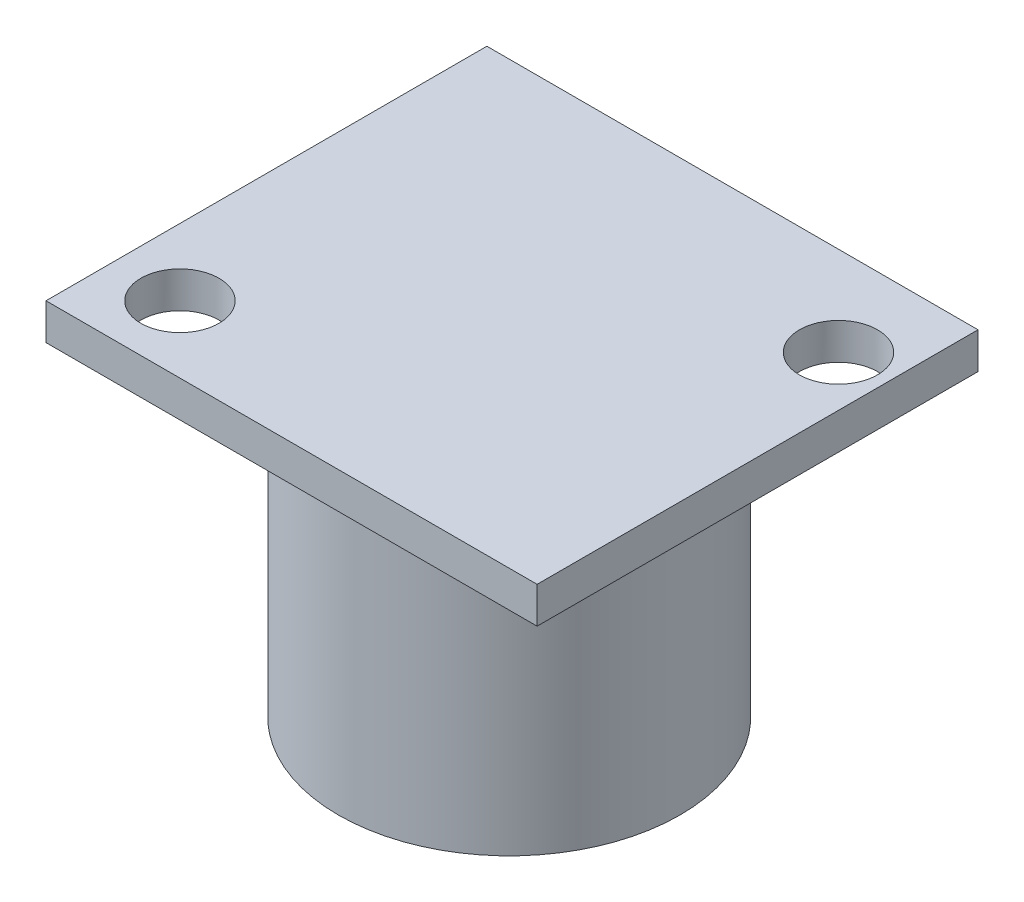
ISO-10303-21;
HEADER;
FILE_DESCRIPTION(('STEP AP214'),'2;1');
FILE_NAME('part.step','',(''),(''),'','','');
FILE_SCHEMA(('AUTOMOTIVE_DESIGN { 1 0 10303 214 1 1 1 1 }'));
ENDSEC;
DATA;
#1=APPLICATION_CONTEXT('core data for automotive mechanical design processes');
#2=APPLICATION_PROTOCOL_DEFINITION('international standard','automotive_design',2000,#1);
#3=PRODUCT_CONTEXT('',#1,'mechanical');
#4=PRODUCT('Part','Part','',(#3));
#5=PRODUCT_RELATED_PRODUCT_CATEGORY('part','',(#4));
#6=PRODUCT_DEFINITION_FORMATION('','',#4);
#7=PRODUCT_DEFINITION_CONTEXT('part definition',#1,'design');
#8=PRODUCT_DEFINITION('design','',#6,#7);
#9=PRODUCT_DEFINITION_SHAPE('','',#8);
#10=(LENGTH_UNIT() NAMED_UNIT(*) SI_UNIT(.MILLI.,.METRE.));
#11=(NAMED_UNIT(*) PLANE_ANGLE_UNIT() SI_UNIT($,.RADIAN.));
#12=(NAMED_UNIT(*) SI_UNIT($,.STERADIAN.) SOLID_ANGLE_UNIT());
#13=UNCERTAINTY_MEASURE_WITH_UNIT(LENGTH_MEASURE(1.E-05),#10,'distance_accuracy_value','');
#14=(GEOMETRIC_REPRESENTATION_CONTEXT(3) GLOBAL_UNCERTAINTY_ASSIGNED_CONTEXT((#13)) GLOBAL_UNIT_ASSIGNED_CONTEXT((#10,
#11,#12)) REPRESENTATION_CONTEXT('',''));
#15=CARTESIAN_POINT('',(0.,0.,0.));
#16=DIRECTION('',(0.,0.,1.));
#17=DIRECTION('',(1.,0.,0.));
#18=AXIS2_PLACEMENT_3D('',#15,#16,#17);
#19=CARTESIAN_POINT('',(0.,1.651,0.));
#20=DIRECTION('',(1.,0.,0.));
#21=DIRECTION('',(0.,0.,-1.));
#22=AXIS2_PLACEMENT_3D('',#19,#20,#21);
#23=PLANE('',#22);
#24=DIRECTION('',(0.,0.,1.));
#25=VECTOR('',#24,1.);
#26=CARTESIAN_POINT('',(0.,0.,0.));
#27=LINE('',#26,#25);
#28=CARTESIAN_POINT('',(0.,0.,-20.066));
#29=VERTEX_POINT('',#28);
#30=CARTESIAN_POINT('',(0.,0.,0.));
#31=VERTEX_POINT('',#30);
#32=EDGE_CURVE('E99',#29,#31,#27,.T.);
#33=ORIENTED_EDGE('',*,*,#32,.T.);
#34=DIRECTION('',(0.,-1.,0.));
#35=VECTOR('',#34,1.);
#36=CARTESIAN_POINT('',(0.,1.651,0.));
#37=LINE('',#36,#35);
#38=CARTESIAN_POINT('',(0.,1.651,0.));
#39=VERTEX_POINT('',#38);
#40=EDGE_CURVE('E41',#39,#31,#37,.T.);
#41=ORIENTED_EDGE('',*,*,#40,.F.);
#42=DIRECTION('',(0.,0.,1.));
#43=VECTOR('',#42,1.);
#44=CARTESIAN_POINT('',(0.,1.651,0.));
#45=LINE('',#44,#43);
#46=CARTESIAN_POINT('',(0.,1.651,-20.066));
#47=VERTEX_POINT('',#46);
#48=EDGE_CURVE('E85',#47,#39,#45,.T.);
#49=ORIENTED_EDGE('',*,*,#48,.F.);
#50=DIRECTION('',(0.,-1.,0.));
#51=VECTOR('',#50,1.);
#52=CARTESIAN_POINT('',(0.,1.651,-20.066));
#53=LINE('',#52,#51);
#54=EDGE_CURVE('E95',#47,#29,#53,.T.);
#55=ORIENTED_EDGE('',*,*,#54,.T.);
#56=EDGE_LOOP('',(#33,#41,#49,#55));
#57=FACE_BOUND('',#56,.T.);
#58=ADVANCED_FACE('F33',(#57),#23,.F.);
#59=CARTESIAN_POINT('',(0.,1.651,0.));
#60=DIRECTION('',(0.,0.,-1.));
#61=DIRECTION('',(-1.,0.,0.));
#62=AXIS2_PLACEMENT_3D('',#59,#60,#61);
#63=PLANE('',#62);
#64=DIRECTION('',(1.,0.,0.));
#65=VECTOR('',#64,1.);
#66=CARTESIAN_POINT('',(0.,0.,0.));
#67=LINE('',#66,#65);
#68=CARTESIAN_POINT('',(22.352,0.,0.));
#69=VERTEX_POINT('',#68);
#70=EDGE_CURVE('E90',#31,#69,#67,.T.);
#71=ORIENTED_EDGE('',*,*,#70,.T.);
#72=DIRECTION('',(0.,-1.,0.));
#73=VECTOR('',#72,1.);
#74=CARTESIAN_POINT('',(22.352,1.651,0.));
#75=LINE('',#74,#73);
#76=CARTESIAN_POINT('',(22.352,1.651,0.));
#77=VERTEX_POINT('',#76);
#78=EDGE_CURVE('E88',#77,#69,#75,.T.);
#79=ORIENTED_EDGE('',*,*,#78,.F.);
#80=DIRECTION('',(1.,0.,0.));
#81=VECTOR('',#80,1.);
#82=CARTESIAN_POINT('',(0.,1.651,0.));
#83=LINE('',#82,#81);
#84=EDGE_CURVE('E80',#39,#77,#83,.T.);
#85=ORIENTED_EDGE('',*,*,#84,.F.);
#86=ORIENTED_EDGE('',*,*,#40,.T.);
#87=EDGE_LOOP('',(#71,#79,#85,#86));
#88=FACE_BOUND('',#87,.T.);
#89=ADVANCED_FACE('F89',(#88),#63,.F.);
#90=CARTESIAN_POINT('',(22.352,1.651,0.));
#91=DIRECTION('',(-1.,0.,0.));
#92=DIRECTION('',(0.,0.,1.));
#93=AXIS2_PLACEMENT_3D('',#90,#91,#92);
#94=PLANE('',#93);
#95=DIRECTION('',(0.,0.,-1.));
#96=VECTOR('',#95,1.);
#97=CARTESIAN_POINT('',(22.352,0.,0.));
#98=LINE('',#97,#96);
#99=CARTESIAN_POINT('',(22.352,0.,-20.066));
#100=VERTEX_POINT('',#99);
#101=EDGE_CURVE('E66',#69,#100,#98,.T.);
#102=ORIENTED_EDGE('',*,*,#101,.T.);
#103=DIRECTION('',(0.,-1.,0.));
#104=VECTOR('',#103,1.);
#105=CARTESIAN_POINT('',(22.352,1.651,-20.066));
#106=LINE('',#105,#104);
#107=CARTESIAN_POINT('',(22.352,1.651,-20.066));
#108=VERTEX_POINT('',#107);
#109=EDGE_CURVE('E91',#108,#100,#106,.T.);
#110=ORIENTED_EDGE('',*,*,#109,.F.);
#111=DIRECTION('',(0.,0.,-1.));
#112=VECTOR('',#111,1.);
#113=CARTESIAN_POINT('',(22.352,1.651,0.));
#114=LINE('',#113,#112);
#115=EDGE_CURVE('E83',#77,#108,#114,.T.);
#116=ORIENTED_EDGE('',*,*,#115,.F.);
#117=ORIENTED_EDGE('',*,*,#78,.T.);
#118=EDGE_LOOP('',(#102,#110,#116,#117));
#119=FACE_BOUND('',#118,.T.);
#120=ADVANCED_FACE('F93',(#119),#94,.F.);
#121=CARTESIAN_POINT('',(0.,1.651,-20.066));
#122=DIRECTION('',(0.,0.,1.));
#123=DIRECTION('',(1.,0.,0.));
#124=AXIS2_PLACEMENT_3D('',#121,#122,#123);
#125=PLANE('',#124);
#126=DIRECTION('',(-1.,0.,0.));
#127=VECTOR('',#126,1.);
#128=CARTESIAN_POINT('',(0.,0.,-20.066));
#129=LINE('',#128,#127);
#130=EDGE_CURVE('E72',#100,#29,#129,.T.);
#131=ORIENTED_EDGE('',*,*,#130,.T.);
#132=ORIENTED_EDGE('',*,*,#54,.F.);
#133=DIRECTION('',(-1.,0.,0.));
#134=VECTOR('',#133,1.);
#135=CARTESIAN_POINT('',(0.,1.651,-20.066));
#136=LINE('',#135,#134);
#137=EDGE_CURVE('E49',#108,#47,#136,.T.);
#138=ORIENTED_EDGE('',*,*,#137,.F.);
#139=ORIENTED_EDGE('',*,*,#109,.T.);
#140=EDGE_LOOP('',(#131,#132,#138,#139));
#141=FACE_BOUND('',#140,.T.);
#142=ADVANCED_FACE('F123',(#141),#125,.F.);
#143=CARTESIAN_POINT('',(0.,1.651,0.));
#144=DIRECTION('',(0.,-1.,0.));
#145=DIRECTION('',(0.,0.,-1.));
#146=AXIS2_PLACEMENT_3D('',#143,#144,#145);
#147=PLANE('',#146);
#148=CARTESIAN_POINT('',(3.048,1.651,-3.048));
#149=DIRECTION('',(0.,1.,0.));
#150=DIRECTION('',(0.,0.,1.));
#151=AXIS2_PLACEMENT_3D('',#148,#149,#150);
#152=CIRCLE('',#151,1.778);
#153=CARTESIAN_POINT('',(3.048,1.651,-1.27));
#154=VERTEX_POINT('',#153);
#155=EDGE_CURVE('E102',#154,#154,#152,.T.);
#156=ORIENTED_EDGE('',*,*,#155,.F.);
#157=EDGE_LOOP('',(#156));
#158=FACE_BOUND('',#157,.T.);
#159=CARTESIAN_POINT('',(20.066,1.651,-16.002));
#160=DIRECTION('',(0.,1.,0.));
#161=DIRECTION('',(0.,0.,1.));
#162=AXIS2_PLACEMENT_3D('',#159,#160,#161);
#163=CIRCLE('',#162,1.778);
#164=CARTESIAN_POINT('',(20.066,1.651,-14.224));
#165=VERTEX_POINT('',#164);
#166=EDGE_CURVE('E227',#165,#165,#163,.T.);
#167=ORIENTED_EDGE('',*,*,#166,.F.);
#168=EDGE_LOOP('',(#167));
#169=FACE_BOUND('',#168,.T.);
#170=ORIENTED_EDGE('',*,*,#48,.T.);
#171=ORIENTED_EDGE('',*,*,#84,.T.);
#172=ORIENTED_EDGE('',*,*,#115,.T.);
#173=ORIENTED_EDGE('',*,*,#137,.T.);
#174=EDGE_LOOP('',(#170,#171,#172,#173));
#175=FACE_BOUND('',#174,.T.);
#176=ADVANCED_FACE('F81',(#158,#169,#175),#147,.F.);
#177=CARTESIAN_POINT('',(0.,0.,0.));
#178=DIRECTION('',(0.,-1.,0.));
#179=DIRECTION('',(0.,0.,-1.));
#180=AXIS2_PLACEMENT_3D('',#177,#178,#179);
#181=PLANE('',#180);
#182=CARTESIAN_POINT('',(11.557,0.,-9.525));
#183=DIRECTION('',(0.,-1.,0.));
#184=DIRECTION('',(0.,0.,-1.));
#185=AXIS2_PLACEMENT_3D('',#182,#183,#184);
#186=CIRCLE('',#185,7.77564841938252);
#187=CARTESIAN_POINT('',(11.557,0.,-17.3006484193825));
#188=VERTEX_POINT('',#187);
#189=EDGE_CURVE('E213',#188,#188,#186,.T.);
#190=ORIENTED_EDGE('',*,*,#189,.F.);
#191=EDGE_LOOP('',(#190));
#192=FACE_BOUND('',#191,.T.);
#193=CARTESIAN_POINT('',(3.048,0.,-3.048));
#194=DIRECTION('',(0.,-1.,0.));
#195=DIRECTION('',(0.,0.,-1.));
#196=AXIS2_PLACEMENT_3D('',#193,#194,#195);
#197=CIRCLE('',#196,1.778);
#198=CARTESIAN_POINT('',(3.048,0.,-4.826));
#199=VERTEX_POINT('',#198);
#200=EDGE_CURVE('E224',#199,#199,#197,.F.);
#201=ORIENTED_EDGE('',*,*,#200,.T.);
#202=EDGE_LOOP('',(#201));
#203=FACE_BOUND('',#202,.T.);
#204=CARTESIAN_POINT('',(20.066,0.,-16.002));
#205=DIRECTION('',(0.,-1.,0.));
#206=DIRECTION('',(0.,0.,-1.));
#207=AXIS2_PLACEMENT_3D('',#204,#205,#206);
#208=CIRCLE('',#207,1.778);
#209=CARTESIAN_POINT('',(20.066,0.,-17.78));
#210=VERTEX_POINT('',#209);
#211=EDGE_CURVE('E220',#210,#210,#208,.F.);
#212=ORIENTED_EDGE('',*,*,#211,.T.);
#213=EDGE_LOOP('',(#212));
#214=FACE_BOUND('',#213,.T.);
#215=ORIENTED_EDGE('',*,*,#32,.F.);
#216=ORIENTED_EDGE('',*,*,#130,.F.);
#217=ORIENTED_EDGE('',*,*,#101,.F.);
#218=ORIENTED_EDGE('',*,*,#70,.F.);
#219=EDGE_LOOP('',(#215,#216,#217,#218));
#220=FACE_BOUND('',#219,.T.);
#221=ADVANCED_FACE('F110',(#192,#203,#214,#220),#181,.T.);
#222=CARTESIAN_POINT('',(20.066,-0.000999999999999916,-16.002));
#223=DIRECTION('',(0.,1.,0.));
#224=DIRECTION('',(0.,0.,1.));
#225=AXIS2_PLACEMENT_3D('',#222,#223,#224);
#226=CYLINDRICAL_SURFACE('',#225,1.778);
#227=ORIENTED_EDGE('',*,*,#211,.F.);
#228=EDGE_LOOP('',(#227));
#229=FACE_BOUND('',#228,.T.);
#230=ORIENTED_EDGE('',*,*,#166,.T.);
#231=EDGE_LOOP('',(#230));
#232=FACE_BOUND('',#231,.T.);
#233=ADVANCED_FACE('F112',(#229,#232),#226,.F.);
#234=CARTESIAN_POINT('',(3.048,-0.000999999999999916,-3.048));
#235=DIRECTION('',(0.,1.,0.));
#236=DIRECTION('',(0.,0.,1.));
#237=AXIS2_PLACEMENT_3D('',#234,#235,#236);
#238=CYLINDRICAL_SURFACE('',#237,1.778);
#239=ORIENTED_EDGE('',*,*,#200,.F.);
#240=EDGE_LOOP('',(#239));
#241=FACE_BOUND('',#240,.T.);
#242=ORIENTED_EDGE('',*,*,#155,.T.);
#243=EDGE_LOOP('',(#242));
#244=FACE_BOUND('',#243,.T.);
#245=ADVANCED_FACE('F120',(#241,#244),#238,.F.);
#246=CARTESIAN_POINT('',(11.557,-13.716,-9.525));
#247=DIRECTION('',(0.,-1.,0.));
#248=DIRECTION('',(0.,0.,-1.));
#249=AXIS2_PLACEMENT_3D('',#246,#247,#248);
#250=PLANE('',#249);
#251=CARTESIAN_POINT('',(11.557,-13.716,-9.525));
#252=DIRECTION('',(0.,-1.,0.));
#253=DIRECTION('',(0.,0.,-1.));
#254=AXIS2_PLACEMENT_3D('',#251,#252,#253);
#255=CIRCLE('',#254,7.77564841938252);
#256=CARTESIAN_POINT('',(11.557,-13.716,-17.3006484193825));
#257=VERTEX_POINT('',#256);
#258=EDGE_CURVE('E216',#257,#257,#255,.T.);
#259=ORIENTED_EDGE('',*,*,#258,.T.);
#260=EDGE_LOOP('',(#259));
#261=FACE_BOUND('',#260,.T.);
#262=CARTESIAN_POINT('',(11.557,-13.716,-9.525));
#263=DIRECTION('',(0.,-1.,0.));
#264=DIRECTION('',(0.,0.,-1.));
#265=AXIS2_PLACEMENT_3D('',#262,#263,#264);
#266=CIRCLE('',#265,6.86223451172798);
#267=CARTESIAN_POINT('',(11.557,-13.716,-16.387234511728));
#268=VERTEX_POINT('',#267);
#269=EDGE_CURVE('E210',#268,#268,#266,.T.);
#270=ORIENTED_EDGE('',*,*,#269,.F.);
#271=EDGE_LOOP('',(#270));
#272=FACE_BOUND('',#271,.T.);
#273=ADVANCED_FACE('F164',(#261,#272),#250,.T.);
#274=CARTESIAN_POINT('',(11.557,-13.716,-9.525));
#275=DIRECTION('',(0.,1.,0.));
#276=DIRECTION('',(0.,0.,1.));
#277=AXIS2_PLACEMENT_3D('',#274,#275,#276);
#278=CYLINDRICAL_SURFACE('',#277,7.77564841938252);
#279=ORIENTED_EDGE('',*,*,#258,.F.);
#280=EDGE_LOOP('',(#279));
#281=FACE_BOUND('',#280,.T.);
#282=ORIENTED_EDGE('',*,*,#189,.T.);
#283=EDGE_LOOP('',(#282));
#284=FACE_BOUND('',#283,.T.);
#285=ADVANCED_FACE('F179',(#281,#284),#278,.T.);
#286=CARTESIAN_POINT('',(11.557,-13.716,-9.525));
#287=DIRECTION('',(0.,1.,0.));
#288=DIRECTION('',(0.,0.,1.));
#289=AXIS2_PLACEMENT_3D('',#286,#287,#288);
#290=CYLINDRICAL_SURFACE('',#289,6.86223451172798);
#291=ORIENTED_EDGE('',*,*,#269,.T.);
#292=EDGE_LOOP('',(#291));
#293=FACE_BOUND('',#292,.T.);
#294=CARTESIAN_POINT('',(11.557,0.,-9.525));
#295=DIRECTION('',(0.,-1.,0.));
#296=DIRECTION('',(0.,0.,-1.));
#297=AXIS2_PLACEMENT_3D('',#294,#295,#296);
#298=CIRCLE('',#297,6.86223451172798);
#299=CARTESIAN_POINT('',(11.557,0.,-16.387234511728));
#300=VERTEX_POINT('',#299);
#301=EDGE_CURVE('E11',#300,#300,#298,.F.);
#302=ORIENTED_EDGE('',*,*,#301,.T.);
#303=EDGE_LOOP('',(#302));
#304=FACE_BOUND('',#303,.T.);
#305=ADVANCED_FACE('F130',(#293,#304),#290,.F.);
#306=ORIENTED_EDGE('',*,*,#301,.F.);
#307=EDGE_LOOP('',(#306));
#308=FACE_BOUND('',#307,.T.);
#309=ADVANCED_FACE('F115',(#308),#181,.T.);
#310=CLOSED_SHELL('',(#58,#89,#120,#142,#176,#221,#233,#245,#273,#285,#305,#309));
#311=MANIFOLD_SOLID_BREP('B2',#310);
#312=ADVANCED_BREP_SHAPE_REPRESENTATION('',(#18,#311),#14);
#313=SHAPE_DEFINITION_REPRESENTATION(#9,#312);
ENDSEC;
END-ISO-10303-21;
